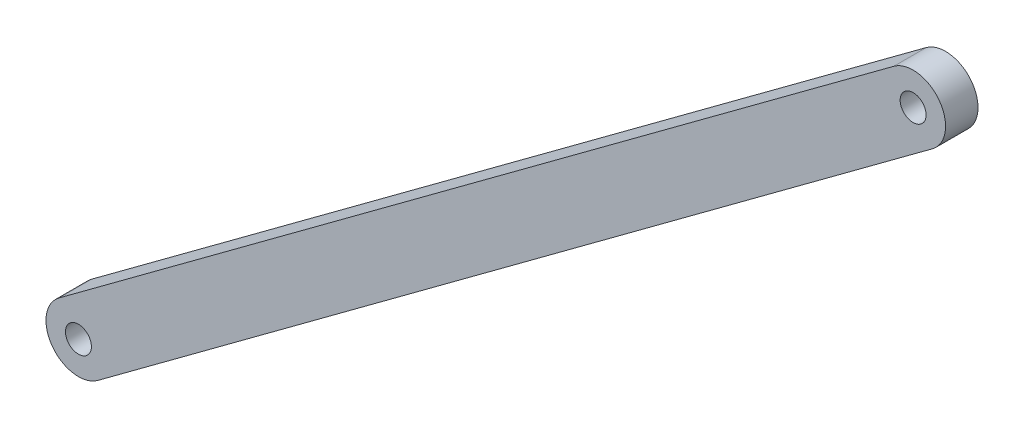
ISO-10303-21;
HEADER;
FILE_DESCRIPTION(('STEP AP214'),'2;1');
FILE_NAME('part.step','',(''),(''),'','','');
FILE_SCHEMA(('AUTOMOTIVE_DESIGN { 1 0 10303 214 1 1 1 1 }'));
ENDSEC;
DATA;
#1=APPLICATION_CONTEXT('core data for automotive mechanical design processes');
#2=APPLICATION_PROTOCOL_DEFINITION('international standard','automotive_design',2000,#1);
#3=PRODUCT_CONTEXT('',#1,'mechanical');
#4=PRODUCT('Part','Part','',(#3));
#5=PRODUCT_RELATED_PRODUCT_CATEGORY('part','',(#4));
#6=PRODUCT_DEFINITION_FORMATION('','',#4);
#7=PRODUCT_DEFINITION_CONTEXT('part definition',#1,'design');
#8=PRODUCT_DEFINITION('design','',#6,#7);
#9=PRODUCT_DEFINITION_SHAPE('','',#8);
#10=(LENGTH_UNIT() NAMED_UNIT(*) SI_UNIT(.MILLI.,.METRE.));
#11=(NAMED_UNIT(*) PLANE_ANGLE_UNIT() SI_UNIT($,.RADIAN.));
#12=(NAMED_UNIT(*) SI_UNIT($,.STERADIAN.) SOLID_ANGLE_UNIT());
#13=UNCERTAINTY_MEASURE_WITH_UNIT(LENGTH_MEASURE(1.E-05),#10,'distance_accuracy_value','');
#14=(GEOMETRIC_REPRESENTATION_CONTEXT(3) GLOBAL_UNCERTAINTY_ASSIGNED_CONTEXT((#13)) GLOBAL_UNIT_ASSIGNED_CONTEXT((#10,
#11,#12)) REPRESENTATION_CONTEXT('',''));
#15=CARTESIAN_POINT('',(0.,0.,0.));
#16=DIRECTION('',(0.,0.,1.));
#17=DIRECTION('',(1.,0.,0.));
#18=AXIS2_PLACEMENT_3D('',#15,#16,#17);
#19=CARTESIAN_POINT('',(-253.944054728589,61.0658585954437,-10.));
#20=DIRECTION('',(0.,0.,1.));
#21=DIRECTION('',(1.,0.,0.));
#22=AXIS2_PLACEMENT_3D('',#19,#20,#21);
#23=CYLINDRICAL_SURFACE('',#22,5.);
#24=CARTESIAN_POINT('',(-253.944054728589,61.0658585954437,-5.));
#25=DIRECTION('',(0.,0.,1.));
#26=DIRECTION('',(1.,0.,0.));
#27=AXIS2_PLACEMENT_3D('',#24,#25,#26);
#28=CIRCLE('',#27,5.);
#29=CARTESIAN_POINT('',(-256.919150515307,65.0844161799327,-5.));
#30=VERTEX_POINT('',#29);
#31=CARTESIAN_POINT('',(-250.968958941871,57.0473010109546,-5.));
#32=VERTEX_POINT('',#31);
#33=EDGE_CURVE('E98',#30,#32,#28,.T.);
#34=ORIENTED_EDGE('',*,*,#33,.F.);
#35=DIRECTION('',(0.,0.,1.));
#36=VECTOR('',#35,1.);
#37=CARTESIAN_POINT('',(-256.919150515307,65.0844161799327,-10.));
#38=LINE('',#37,#36);
#39=CARTESIAN_POINT('',(-256.919150515307,65.0844161799327,-10.));
#40=VERTEX_POINT('',#39);
#41=EDGE_CURVE('E11',#40,#30,#38,.T.);
#42=ORIENTED_EDGE('',*,*,#41,.F.);
#43=CARTESIAN_POINT('',(-253.944054728589,61.0658585954437,-10.));
#44=DIRECTION('',(0.,0.,1.));
#45=DIRECTION('',(1.,0.,0.));
#46=AXIS2_PLACEMENT_3D('',#43,#44,#45);
#47=CIRCLE('',#46,5.);
#48=CARTESIAN_POINT('',(-250.968958941871,57.0473010109546,-10.));
#49=VERTEX_POINT('',#48);
#50=EDGE_CURVE('E91',#40,#49,#47,.T.);
#51=ORIENTED_EDGE('',*,*,#50,.T.);
#52=DIRECTION('',(0.,0.,1.));
#53=VECTOR('',#52,1.);
#54=CARTESIAN_POINT('',(-250.968958941871,57.0473010109546,-10.));
#55=LINE('',#54,#53);
#56=EDGE_CURVE('E36',#49,#32,#55,.T.);
#57=ORIENTED_EDGE('',*,*,#56,.T.);
#58=EDGE_LOOP('',(#34,#42,#51,#57));
#59=FACE_BOUND('',#58,.T.);
#60=ADVANCED_FACE('F33',(#59),#23,.T.);
#61=CARTESIAN_POINT('',(-256.919150515307,65.0844161799327,-10.));
#62=DIRECTION('',(-0.595019157343558,0.803711516897799,0.));
#63=DIRECTION('',(-0.803711516897799,-0.595019157343559,0.));
#64=AXIS2_PLACEMENT_3D('',#61,#62,#63);
#65=PLANE('',#64);
#66=DIRECTION('',(-0.803711516897799,-0.595019157343558,0.));
#67=VECTOR('',#66,1.);
#68=CARTESIAN_POINT('',(-256.919150515307,65.0844161799327,-5.));
#69=LINE('',#68,#67);
#70=CARTESIAN_POINT('',(-128.325307811659,160.287481354902,-5.));
#71=VERTEX_POINT('',#70);
#72=EDGE_CURVE('E93',#71,#30,#69,.T.);
#73=ORIENTED_EDGE('',*,*,#72,.F.);
#74=DIRECTION('',(0.,0.,1.));
#75=VECTOR('',#74,1.);
#76=CARTESIAN_POINT('',(-128.325307811659,160.287481354902,-10.));
#77=LINE('',#76,#75);
#78=CARTESIAN_POINT('',(-128.325307811659,160.287481354902,-10.));
#79=VERTEX_POINT('',#78);
#80=EDGE_CURVE('E42',#79,#71,#77,.T.);
#81=ORIENTED_EDGE('',*,*,#80,.F.);
#82=DIRECTION('',(-0.803711516897799,-0.595019157343558,0.));
#83=VECTOR('',#82,1.);
#84=CARTESIAN_POINT('',(-256.919150515307,65.0844161799327,-10.));
#85=LINE('',#84,#83);
#86=EDGE_CURVE('E88',#79,#40,#85,.T.);
#87=ORIENTED_EDGE('',*,*,#86,.T.);
#88=ORIENTED_EDGE('',*,*,#41,.T.);
#89=EDGE_LOOP('',(#73,#81,#87,#88));
#90=FACE_BOUND('',#89,.T.);
#91=ADVANCED_FACE('F109',(#90),#65,.T.);
#92=CARTESIAN_POINT('',(-125.350212024941,156.268923770413,-10.));
#93=DIRECTION('',(0.,0.,1.));
#94=DIRECTION('',(1.,0.,0.));
#95=AXIS2_PLACEMENT_3D('',#92,#93,#94);
#96=CYLINDRICAL_SURFACE('',#95,4.99999999999993);
#97=CARTESIAN_POINT('',(-125.350212024941,156.268923770413,-5.));
#98=DIRECTION('',(0.,0.,1.));
#99=DIRECTION('',(1.,0.,0.));
#100=AXIS2_PLACEMENT_3D('',#97,#98,#99);
#101=CIRCLE('',#100,4.99999999999993);
#102=CARTESIAN_POINT('',(-122.375116238223,152.250366185924,-5.));
#103=VERTEX_POINT('',#102);
#104=EDGE_CURVE('E83',#103,#71,#101,.T.);
#105=ORIENTED_EDGE('',*,*,#104,.F.);
#106=DIRECTION('',(0.,0.,1.));
#107=VECTOR('',#106,1.);
#108=CARTESIAN_POINT('',(-122.375116238223,152.250366185924,-10.));
#109=LINE('',#108,#107);
#110=CARTESIAN_POINT('',(-122.375116238223,152.250366185924,-10.));
#111=VERTEX_POINT('',#110);
#112=EDGE_CURVE('E78',#111,#103,#109,.T.);
#113=ORIENTED_EDGE('',*,*,#112,.F.);
#114=CARTESIAN_POINT('',(-125.350212024941,156.268923770413,-10.));
#115=DIRECTION('',(0.,0.,1.));
#116=DIRECTION('',(1.,0.,0.));
#117=AXIS2_PLACEMENT_3D('',#114,#115,#116);
#118=CIRCLE('',#117,4.99999999999993);
#119=EDGE_CURVE('E81',#111,#79,#118,.T.);
#120=ORIENTED_EDGE('',*,*,#119,.T.);
#121=ORIENTED_EDGE('',*,*,#80,.T.);
#122=EDGE_LOOP('',(#105,#113,#120,#121));
#123=FACE_BOUND('',#122,.T.);
#124=ADVANCED_FACE('F80',(#123),#96,.T.);
#125=CARTESIAN_POINT('',(-122.375116238223,152.250366185924,-10.));
#126=DIRECTION('',(0.595019157343559,-0.803711516897799,0.));
#127=DIRECTION('',(0.803711516897799,0.595019157343559,0.));
#128=AXIS2_PLACEMENT_3D('',#125,#126,#127);
#129=PLANE('',#128);
#130=DIRECTION('',(0.803711516897799,0.595019157343559,0.));
#131=VECTOR('',#130,1.);
#132=CARTESIAN_POINT('',(-122.375116238223,152.250366185924,-5.));
#133=LINE('',#132,#131);
#134=EDGE_CURVE('E101',#32,#103,#133,.T.);
#135=ORIENTED_EDGE('',*,*,#134,.F.);
#136=ORIENTED_EDGE('',*,*,#56,.F.);
#137=DIRECTION('',(0.803711516897799,0.595019157343559,0.));
#138=VECTOR('',#137,1.);
#139=CARTESIAN_POINT('',(-122.375116238223,152.250366185924,-10.));
#140=LINE('',#139,#138);
#141=EDGE_CURVE('E87',#49,#111,#140,.T.);
#142=ORIENTED_EDGE('',*,*,#141,.T.);
#143=ORIENTED_EDGE('',*,*,#112,.T.);
#144=EDGE_LOOP('',(#135,#136,#142,#143));
#145=FACE_BOUND('',#144,.T.);
#146=ADVANCED_FACE('F90',(#145),#129,.T.);
#147=CARTESIAN_POINT('',(-253.944054728589,61.0658585954437,-10.));
#148=DIRECTION('',(0.,0.,1.));
#149=DIRECTION('',(1.,0.,0.));
#150=AXIS2_PLACEMENT_3D('',#147,#148,#149);
#151=PLANE('',#150);
#152=CARTESIAN_POINT('',(-253.944054728589,61.0658585954437,-10.));
#153=DIRECTION('',(0.,0.,1.));
#154=DIRECTION('',(1.,0.,0.));
#155=AXIS2_PLACEMENT_3D('',#152,#153,#154);
#156=CIRCLE('',#155,2.);
#157=CARTESIAN_POINT('',(-251.944054728589,61.0658585954437,-10.));
#158=VERTEX_POINT('',#157);
#159=EDGE_CURVE('E142',#158,#158,#156,.T.);
#160=ORIENTED_EDGE('',*,*,#159,.T.);
#161=EDGE_LOOP('',(#160));
#162=FACE_BOUND('',#161,.T.);
#163=CARTESIAN_POINT('',(-125.350212024941,156.268923770413,-10.));
#164=DIRECTION('',(0.,0.,1.));
#165=DIRECTION('',(1.,0.,0.));
#166=AXIS2_PLACEMENT_3D('',#163,#164,#165);
#167=CIRCLE('',#166,1.99999999999997);
#168=CARTESIAN_POINT('',(-123.350212024941,156.268923770413,-10.));
#169=VERTEX_POINT('',#168);
#170=EDGE_CURVE('E102',#169,#169,#167,.T.);
#171=ORIENTED_EDGE('',*,*,#170,.T.);
#172=EDGE_LOOP('',(#171));
#173=FACE_BOUND('',#172,.T.);
#174=ORIENTED_EDGE('',*,*,#50,.F.);
#175=ORIENTED_EDGE('',*,*,#86,.F.);
#176=ORIENTED_EDGE('',*,*,#119,.F.);
#177=ORIENTED_EDGE('',*,*,#141,.F.);
#178=EDGE_LOOP('',(#174,#175,#176,#177));
#179=FACE_BOUND('',#178,.T.);
#180=ADVANCED_FACE('F86',(#162,#173,#179),#151,.F.);
#181=CARTESIAN_POINT('',(-253.944054728589,61.0658585954437,-5.));
#182=DIRECTION('',(0.,0.,1.));
#183=DIRECTION('',(1.,0.,0.));
#184=AXIS2_PLACEMENT_3D('',#181,#182,#183);
#185=PLANE('',#184);
#186=CARTESIAN_POINT('',(-253.944054728589,61.0658585954437,-5.));
#187=DIRECTION('',(0.,0.,1.));
#188=DIRECTION('',(1.,0.,0.));
#189=AXIS2_PLACEMENT_3D('',#186,#187,#188);
#190=CIRCLE('',#189,2.);
#191=CARTESIAN_POINT('',(-251.944054728589,61.0658585954437,-5.));
#192=VERTEX_POINT('',#191);
#193=EDGE_CURVE('E145',#192,#192,#190,.T.);
#194=ORIENTED_EDGE('',*,*,#193,.F.);
#195=EDGE_LOOP('',(#194));
#196=FACE_BOUND('',#195,.T.);
#197=CARTESIAN_POINT('',(-125.350212024941,156.268923770413,-5.));
#198=DIRECTION('',(0.,0.,1.));
#199=DIRECTION('',(1.,0.,0.));
#200=AXIS2_PLACEMENT_3D('',#197,#198,#199);
#201=CIRCLE('',#200,1.99999999999997);
#202=CARTESIAN_POINT('',(-123.350212024941,156.268923770413,-5.));
#203=VERTEX_POINT('',#202);
#204=EDGE_CURVE('E147',#203,#203,#201,.T.);
#205=ORIENTED_EDGE('',*,*,#204,.F.);
#206=EDGE_LOOP('',(#205));
#207=FACE_BOUND('',#206,.T.);
#208=ORIENTED_EDGE('',*,*,#33,.T.);
#209=ORIENTED_EDGE('',*,*,#134,.T.);
#210=ORIENTED_EDGE('',*,*,#104,.T.);
#211=ORIENTED_EDGE('',*,*,#72,.T.);
#212=EDGE_LOOP('',(#208,#209,#210,#211));
#213=FACE_BOUND('',#212,.T.);
#214=ADVANCED_FACE('F108',(#196,#207,#213),#185,.T.);
#215=CARTESIAN_POINT('',(-125.350212024941,156.268923770413,-10.));
#216=DIRECTION('',(0.,0.,1.));
#217=DIRECTION('',(1.,0.,0.));
#218=AXIS2_PLACEMENT_3D('',#215,#216,#217);
#219=CYLINDRICAL_SURFACE('',#218,1.99999999999997);
#220=ORIENTED_EDGE('',*,*,#170,.F.);
#221=EDGE_LOOP('',(#220));
#222=FACE_BOUND('',#221,.T.);
#223=ORIENTED_EDGE('',*,*,#204,.T.);
#224=EDGE_LOOP('',(#223));
#225=FACE_BOUND('',#224,.T.);
#226=ADVANCED_FACE('F127',(#222,#225),#219,.F.);
#227=CARTESIAN_POINT('',(-253.944054728589,61.0658585954437,-10.));
#228=DIRECTION('',(0.,0.,1.));
#229=DIRECTION('',(1.,0.,0.));
#230=AXIS2_PLACEMENT_3D('',#227,#228,#229);
#231=CYLINDRICAL_SURFACE('',#230,2.);
#232=ORIENTED_EDGE('',*,*,#159,.F.);
#233=EDGE_LOOP('',(#232));
#234=FACE_BOUND('',#233,.T.);
#235=ORIENTED_EDGE('',*,*,#193,.T.);
#236=EDGE_LOOP('',(#235));
#237=FACE_BOUND('',#236,.T.);
#238=ADVANCED_FACE('F134',(#234,#237),#231,.F.);
#239=CLOSED_SHELL('',(#60,#91,#124,#146,#180,#214,#226,#238));
#240=MANIFOLD_SOLID_BREP('B2',#239);
#241=ADVANCED_BREP_SHAPE_REPRESENTATION('',(#18,#240),#14);
#242=SHAPE_DEFINITION_REPRESENTATION(#9,#241);
ENDSEC;
END-ISO-10303-21;
